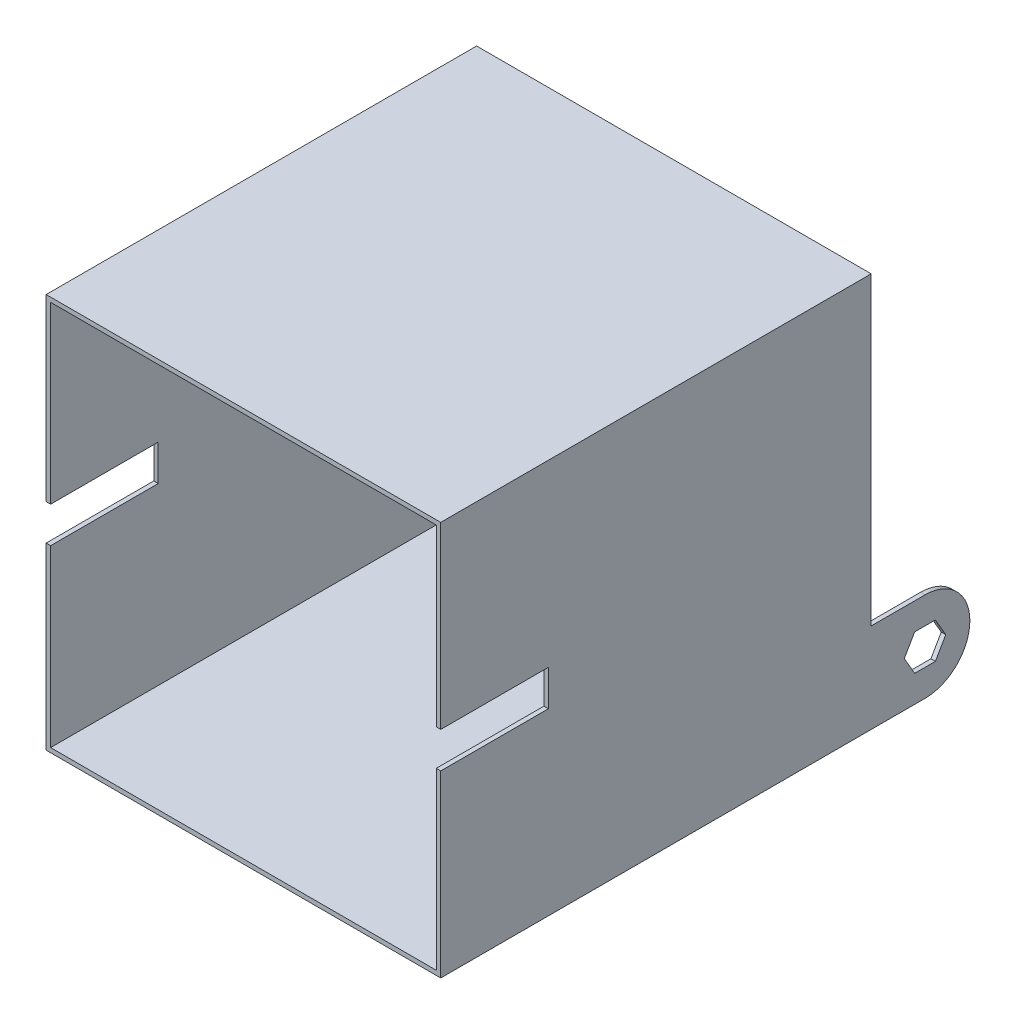
ISO-10303-21;
HEADER;
FILE_DESCRIPTION(('STEP AP214'),'2;1');
FILE_NAME('part.step','',(''),(''),'','','');
FILE_SCHEMA(('AUTOMOTIVE_DESIGN { 1 0 10303 214 1 1 1 1 }'));
ENDSEC;
DATA;
#1=APPLICATION_CONTEXT('core data for automotive mechanical design processes');
#2=APPLICATION_PROTOCOL_DEFINITION('international standard','automotive_design',2000,#1);
#3=PRODUCT_CONTEXT('',#1,'mechanical');
#4=PRODUCT('Part','Part','',(#3));
#5=PRODUCT_RELATED_PRODUCT_CATEGORY('part','',(#4));
#6=PRODUCT_DEFINITION_FORMATION('','',#4);
#7=PRODUCT_DEFINITION_CONTEXT('part definition',#1,'design');
#8=PRODUCT_DEFINITION('design','',#6,#7);
#9=PRODUCT_DEFINITION_SHAPE('','',#8);
#10=(LENGTH_UNIT() NAMED_UNIT(*) SI_UNIT(.MILLI.,.METRE.));
#11=(NAMED_UNIT(*) PLANE_ANGLE_UNIT() SI_UNIT($,.RADIAN.));
#12=(NAMED_UNIT(*) SI_UNIT($,.STERADIAN.) SOLID_ANGLE_UNIT());
#13=UNCERTAINTY_MEASURE_WITH_UNIT(LENGTH_MEASURE(1.E-05),#10,'distance_accuracy_value','');
#14=(GEOMETRIC_REPRESENTATION_CONTEXT(3) GLOBAL_UNCERTAINTY_ASSIGNED_CONTEXT((#13)) GLOBAL_UNIT_ASSIGNED_CONTEXT((#10,
#11,#12)) REPRESENTATION_CONTEXT('',''));
#15=CARTESIAN_POINT('',(0.,0.,0.));
#16=DIRECTION('',(0.,0.,1.));
#17=DIRECTION('',(1.,0.,0.));
#18=AXIS2_PLACEMENT_3D('',#15,#16,#17);
#19=CARTESIAN_POINT('',(0.,0.,0.));
#20=DIRECTION('',(0.,0.,-1.));
#21=DIRECTION('',(-1.,0.,0.));
#22=AXIS2_PLACEMENT_3D('',#19,#20,#21);
#23=PLANE('',#22);
#24=CARTESIAN_POINT('',(139.7,139.7,0.));
#25=DIRECTION('',(0.,0.,-1.));
#26=DIRECTION('',(-1.,0.,0.));
#27=AXIS2_PLACEMENT_3D('',#24,#25,#26);
#28=CIRCLE('',#27,12.7);
#29=CARTESIAN_POINT('',(127.,139.7,0.));
#30=VERTEX_POINT('',#29);
#31=EDGE_CURVE('E289',#30,#30,#28,.T.);
#32=ORIENTED_EDGE('',*,*,#31,.F.);
#33=EDGE_LOOP('',(#32));
#34=FACE_BOUND('',#33,.T.);
#35=DIRECTION('',(0.,1.,0.));
#36=VECTOR('',#35,1.);
#37=CARTESIAN_POINT('',(3.175,0.,0.));
#38=LINE('',#37,#36);
#39=CARTESIAN_POINT('',(3.175,0.,0.));
#40=VERTEX_POINT('',#39);
#41=CARTESIAN_POINT('',(3.175,63.5,0.));
#42=VERTEX_POINT('',#41);
#43=EDGE_CURVE('E266',#40,#42,#38,.T.);
#44=ORIENTED_EDGE('',*,*,#43,.T.);
#45=DIRECTION('',(-1.,0.,0.));
#46=VECTOR('',#45,1.);
#47=CARTESIAN_POINT('',(3.175,63.5,0.));
#48=LINE('',#47,#46);
#49=CARTESIAN_POINT('',(0.,63.5,0.));
#50=VERTEX_POINT('',#49);
#51=EDGE_CURVE('E277',#42,#50,#48,.T.);
#52=ORIENTED_EDGE('',*,*,#51,.T.);
#53=DIRECTION('',(0.,-1.,0.));
#54=VECTOR('',#53,1.);
#55=CARTESIAN_POINT('',(0.,0.,0.));
#56=LINE('',#55,#54);
#57=CARTESIAN_POINT('',(0.,279.4,0.));
#58=VERTEX_POINT('',#57);
#59=EDGE_CURVE('E418',#58,#50,#56,.T.);
#60=ORIENTED_EDGE('',*,*,#59,.F.);
#61=DIRECTION('',(-1.,0.,0.));
#62=VECTOR('',#61,1.);
#63=CARTESIAN_POINT('',(0.,279.4,0.));
#64=LINE('',#63,#62);
#65=CARTESIAN_POINT('',(279.4,279.4,0.));
#66=VERTEX_POINT('',#65);
#67=EDGE_CURVE('E425',#66,#58,#64,.T.);
#68=ORIENTED_EDGE('',*,*,#67,.F.);
#69=DIRECTION('',(0.,1.,0.));
#70=VECTOR('',#69,1.);
#71=CARTESIAN_POINT('',(279.4,0.,0.));
#72=LINE('',#71,#70);
#73=CARTESIAN_POINT('',(279.4,63.5,0.));
#74=VERTEX_POINT('',#73);
#75=EDGE_CURVE('E60',#74,#66,#72,.T.);
#76=ORIENTED_EDGE('',*,*,#75,.F.);
#77=DIRECTION('',(1.,0.,0.));
#78=VECTOR('',#77,1.);
#79=CARTESIAN_POINT('',(276.225,63.5,0.));
#80=LINE('',#79,#78);
#81=CARTESIAN_POINT('',(276.225,63.5,0.));
#82=VERTEX_POINT('',#81);
#83=EDGE_CURVE('E405',#82,#74,#80,.T.);
#84=ORIENTED_EDGE('',*,*,#83,.F.);
#85=DIRECTION('',(0.,1.,0.));
#86=VECTOR('',#85,1.);
#87=CARTESIAN_POINT('',(276.225,0.,0.));
#88=LINE('',#87,#86);
#89=CARTESIAN_POINT('',(276.225,0.,0.));
#90=VERTEX_POINT('',#89);
#91=EDGE_CURVE('E352',#90,#82,#88,.T.);
#92=ORIENTED_EDGE('',*,*,#91,.F.);
#93=DIRECTION('',(1.,0.,0.));
#94=VECTOR('',#93,1.);
#95=CARTESIAN_POINT('',(0.,0.,0.));
#96=LINE('',#95,#94);
#97=EDGE_CURVE('E52',#40,#90,#96,.T.);
#98=ORIENTED_EDGE('',*,*,#97,.F.);
#99=EDGE_LOOP('',(#44,#52,#60,#68,#76,#84,#92,#98));
#100=FACE_BOUND('',#99,.T.);
#101=ADVANCED_FACE('F35',(#34,#100),#23,.T.);
#102=CARTESIAN_POINT('',(0.,0.,304.8));
#103=DIRECTION('',(0.,0.,-1.));
#104=DIRECTION('',(-1.,0.,0.));
#105=AXIS2_PLACEMENT_3D('',#102,#103,#104);
#106=PLANE('',#105);
#107=DIRECTION('',(0.,-1.,0.));
#108=VECTOR('',#107,1.);
#109=CARTESIAN_POINT('',(0.,0.,304.8));
#110=LINE('',#109,#108);
#111=CARTESIAN_POINT('',(0.,279.4,304.8));
#112=VERTEX_POINT('',#111);
#113=CARTESIAN_POINT('',(0.,152.4,304.8));
#114=VERTEX_POINT('',#113);
#115=EDGE_CURVE('E532',#112,#114,#110,.T.);
#116=ORIENTED_EDGE('',*,*,#115,.T.);
#117=DIRECTION('',(-1.,0.,0.));
#118=VECTOR('',#117,1.);
#119=CARTESIAN_POINT('',(279.4,152.4,304.8));
#120=LINE('',#119,#118);
#121=CARTESIAN_POINT('',(3.17499999999998,152.4,304.8));
#122=VERTEX_POINT('',#121);
#123=EDGE_CURVE('E485',#122,#114,#120,.T.);
#124=ORIENTED_EDGE('',*,*,#123,.F.);
#125=DIRECTION('',(0.,-1.,0.));
#126=VECTOR('',#125,1.);
#127=CARTESIAN_POINT('',(3.175,0.,304.8));
#128=LINE('',#127,#126);
#129=CARTESIAN_POINT('',(3.175,276.225,304.8));
#130=VERTEX_POINT('',#129);
#131=EDGE_CURVE('E524',#130,#122,#128,.T.);
#132=ORIENTED_EDGE('',*,*,#131,.F.);
#133=DIRECTION('',(-1.,0.,0.));
#134=VECTOR('',#133,1.);
#135=CARTESIAN_POINT('',(0.,276.225,304.8));
#136=LINE('',#135,#134);
#137=CARTESIAN_POINT('',(276.225,276.225,304.8));
#138=VERTEX_POINT('',#137);
#139=EDGE_CURVE('E513',#138,#130,#136,.T.);
#140=ORIENTED_EDGE('',*,*,#139,.F.);
#141=DIRECTION('',(0.,1.,0.));
#142=VECTOR('',#141,1.);
#143=CARTESIAN_POINT('',(276.225,0.,304.8));
#144=LINE('',#143,#142);
#145=CARTESIAN_POINT('',(276.225,152.4,304.8));
#146=VERTEX_POINT('',#145);
#147=EDGE_CURVE('E529',#146,#138,#144,.T.);
#148=ORIENTED_EDGE('',*,*,#147,.F.);
#149=CARTESIAN_POINT('',(279.4,152.4,304.8));
#150=VERTEX_POINT('',#149);
#151=EDGE_CURVE('E488',#150,#146,#120,.T.);
#152=ORIENTED_EDGE('',*,*,#151,.F.);
#153=DIRECTION('',(0.,1.,0.));
#154=VECTOR('',#153,1.);
#155=CARTESIAN_POINT('',(279.4,0.,304.8));
#156=LINE('',#155,#154);
#157=CARTESIAN_POINT('',(279.4,279.4,304.8));
#158=VERTEX_POINT('',#157);
#159=EDGE_CURVE('E538',#150,#158,#156,.T.);
#160=ORIENTED_EDGE('',*,*,#159,.T.);
#161=DIRECTION('',(-1.,0.,0.));
#162=VECTOR('',#161,1.);
#163=CARTESIAN_POINT('',(0.,279.4,304.8));
#164=LINE('',#163,#162);
#165=EDGE_CURVE('E539',#158,#112,#164,.T.);
#166=ORIENTED_EDGE('',*,*,#165,.T.);
#167=EDGE_LOOP('',(#116,#124,#132,#140,#148,#152,#160,#166));
#168=FACE_BOUND('',#167,.T.);
#169=ADVANCED_FACE('F564',(#168),#106,.F.);
#170=CARTESIAN_POINT('',(279.4,0.,304.8));
#171=VERTEX_POINT('',#170);
#172=CARTESIAN_POINT('',(279.4,127.,304.8));
#173=VERTEX_POINT('',#172);
#174=EDGE_CURVE('E452',#171,#173,#156,.T.);
#175=ORIENTED_EDGE('',*,*,#174,.T.);
#176=DIRECTION('',(-1.,0.,0.));
#177=VECTOR('',#176,1.);
#178=CARTESIAN_POINT('',(279.4,127.,304.8));
#179=LINE('',#178,#177);
#180=CARTESIAN_POINT('',(276.225,127.,304.8));
#181=VERTEX_POINT('',#180);
#182=EDGE_CURVE('E481',#173,#181,#179,.T.);
#183=ORIENTED_EDGE('',*,*,#182,.T.);
#184=CARTESIAN_POINT('',(276.225,3.175,304.8));
#185=VERTEX_POINT('',#184);
#186=EDGE_CURVE('E477',#185,#181,#144,.T.);
#187=ORIENTED_EDGE('',*,*,#186,.F.);
#188=DIRECTION('',(1.,0.,0.));
#189=VECTOR('',#188,1.);
#190=CARTESIAN_POINT('',(0.,3.175,304.8));
#191=LINE('',#190,#189);
#192=CARTESIAN_POINT('',(3.175,3.175,304.8));
#193=VERTEX_POINT('',#192);
#194=EDGE_CURVE('E527',#193,#185,#191,.T.);
#195=ORIENTED_EDGE('',*,*,#194,.F.);
#196=CARTESIAN_POINT('',(3.175,127.,304.8));
#197=VERTEX_POINT('',#196);
#198=EDGE_CURVE('E523',#197,#193,#128,.T.);
#199=ORIENTED_EDGE('',*,*,#198,.F.);
#200=CARTESIAN_POINT('',(0.,127.,304.8));
#201=VERTEX_POINT('',#200);
#202=EDGE_CURVE('E486',#197,#201,#179,.T.);
#203=ORIENTED_EDGE('',*,*,#202,.T.);
#204=CARTESIAN_POINT('',(0.,0.,304.8));
#205=VERTEX_POINT('',#204);
#206=EDGE_CURVE('E536',#201,#205,#110,.T.);
#207=ORIENTED_EDGE('',*,*,#206,.T.);
#208=DIRECTION('',(1.,0.,0.));
#209=VECTOR('',#208,1.);
#210=CARTESIAN_POINT('',(0.,0.,304.8));
#211=LINE('',#210,#209);
#212=EDGE_CURVE('E535',#205,#171,#211,.T.);
#213=ORIENTED_EDGE('',*,*,#212,.T.);
#214=EDGE_LOOP('',(#175,#183,#187,#195,#199,#203,#207,#213));
#215=FACE_BOUND('',#214,.T.);
#216=ADVANCED_FACE('F483',(#215),#106,.F.);
#217=CARTESIAN_POINT('',(0.,0.,304.8));
#218=DIRECTION('',(1.,0.,0.));
#219=DIRECTION('',(0.,0.,-1.));
#220=AXIS2_PLACEMENT_3D('',#217,#218,#219);
#221=PLANE('',#220);
#222=DIRECTION('',(0.,-1.,0.));
#223=VECTOR('',#222,1.);
#224=CARTESIAN_POINT('',(0.,152.4,228.6));
#225=LINE('',#224,#223);
#226=CARTESIAN_POINT('',(0.,152.4,228.6));
#227=VERTEX_POINT('',#226);
#228=CARTESIAN_POINT('',(0.,127.,228.6));
#229=VERTEX_POINT('',#228);
#230=EDGE_CURVE('E386',#227,#229,#225,.T.);
#231=ORIENTED_EDGE('',*,*,#230,.F.);
#232=DIRECTION('',(0.,0.,-1.));
#233=VECTOR('',#232,1.);
#234=CARTESIAN_POINT('',(0.,152.4,228.6));
#235=LINE('',#234,#233);
#236=EDGE_CURVE('E574',#114,#227,#235,.T.);
#237=ORIENTED_EDGE('',*,*,#236,.F.);
#238=ORIENTED_EDGE('',*,*,#115,.F.);
#239=DIRECTION('',(0.,0.,-1.));
#240=VECTOR('',#239,1.);
#241=CARTESIAN_POINT('',(0.,279.4,304.8));
#242=LINE('',#241,#240);
#243=EDGE_CURVE('E458',#112,#58,#242,.T.);
#244=ORIENTED_EDGE('',*,*,#243,.T.);
#245=ORIENTED_EDGE('',*,*,#59,.T.);
#246=DIRECTION('',(0.,0.,1.));
#247=VECTOR('',#246,1.);
#248=CARTESIAN_POINT('',(0.,63.5,0.));
#249=LINE('',#248,#247);
#250=CARTESIAN_POINT('',(0.,63.5,-38.1));
#251=VERTEX_POINT('',#250);
#252=EDGE_CURVE('E313',#251,#50,#249,.T.);
#253=ORIENTED_EDGE('',*,*,#252,.F.);
#254=CARTESIAN_POINT('',(0.,31.75,-38.1));
#255=DIRECTION('',(1.,0.,0.));
#256=DIRECTION('',(0.,0.,-1.));
#257=AXIS2_PLACEMENT_3D('',#254,#255,#256);
#258=CIRCLE('',#257,31.75);
#259=CARTESIAN_POINT('',(0.,0.,-38.1));
#260=VERTEX_POINT('',#259);
#261=EDGE_CURVE('E311',#260,#251,#258,.T.);
#262=ORIENTED_EDGE('',*,*,#261,.F.);
#263=DIRECTION('',(0.,0.,-1.));
#264=VECTOR('',#263,1.);
#265=CARTESIAN_POINT('',(0.,0.,304.8));
#266=LINE('',#265,#264);
#267=EDGE_CURVE('E273',#205,#260,#266,.T.);
#268=ORIENTED_EDGE('',*,*,#267,.F.);
#269=ORIENTED_EDGE('',*,*,#206,.F.);
#270=DIRECTION('',(0.,0.,1.));
#271=VECTOR('',#270,1.);
#272=CARTESIAN_POINT('',(0.,127.,228.6));
#273=LINE('',#272,#271);
#274=EDGE_CURVE('E557',#229,#201,#273,.T.);
#275=ORIENTED_EDGE('',*,*,#274,.F.);
#276=EDGE_LOOP('',(#231,#237,#238,#244,#245,#253,#262,#268,#269,#275));
#277=FACE_BOUND('',#276,.T.);
#278=DIRECTION('',(0.,0.,1.));
#279=VECTOR('',#278,1.);
#280=CARTESIAN_POINT('',(0.,44.45,0.));
#281=LINE('',#280,#279);
#282=CARTESIAN_POINT('',(0.,44.45,-45.4323484187082));
#283=VERTEX_POINT('',#282);
#284=CARTESIAN_POINT('',(0.,44.45,-30.7676515812917));
#285=VERTEX_POINT('',#284);
#286=EDGE_CURVE('E315',#283,#285,#281,.T.);
#287=ORIENTED_EDGE('',*,*,#286,.T.);
#288=DIRECTION('',(0.,-0.866025403784439,0.5));
#289=VECTOR('',#288,1.);
#290=CARTESIAN_POINT('',(0.,-2.21028394209355,-3.82832408685966));
#291=LINE('',#290,#289);
#292=CARTESIAN_POINT('',(0.,31.75,-23.4353031625835));
#293=VERTEX_POINT('',#292);
#294=EDGE_CURVE('E318',#285,#293,#291,.T.);
#295=ORIENTED_EDGE('',*,*,#294,.T.);
#296=DIRECTION('',(0.,-0.866025403784439,-0.5));
#297=VECTOR('',#296,1.);
#298=CARTESIAN_POINT('',(0.,18.0852839420935,-31.3246306570156));
#299=LINE('',#298,#297);
#300=CARTESIAN_POINT('',(0.,19.05,-30.7676515812917));
#301=VERTEX_POINT('',#300);
#302=EDGE_CURVE('E321',#293,#301,#299,.T.);
#303=ORIENTED_EDGE('',*,*,#302,.T.);
#304=DIRECTION('',(0.,0.,-1.));
#305=VECTOR('',#304,1.);
#306=CARTESIAN_POINT('',(0.,19.05,0.));
#307=LINE('',#306,#305);
#308=CARTESIAN_POINT('',(0.,19.05,-45.4323484187083));
#309=VERTEX_POINT('',#308);
#310=EDGE_CURVE('E324',#301,#309,#307,.T.);
#311=ORIENTED_EDGE('',*,*,#310,.T.);
#312=DIRECTION('',(0.,0.866025403784439,-0.5));
#313=VECTOR('',#312,1.);
#314=CARTESIAN_POINT('',(0.,-14.9102839420936,-25.8253693429844));
#315=LINE('',#314,#313);
#316=CARTESIAN_POINT('',(0.,31.75,-52.7646968374165));
#317=VERTEX_POINT('',#316);
#318=EDGE_CURVE('E286',#309,#317,#315,.T.);
#319=ORIENTED_EDGE('',*,*,#318,.T.);
#320=DIRECTION('',(0.,0.866025403784439,0.5));
#321=VECTOR('',#320,1.);
#322=CARTESIAN_POINT('',(0.,30.7852839420936,-53.3216759131403));
#323=LINE('',#322,#321);
#324=EDGE_CURVE('E283',#317,#283,#323,.T.);
#325=ORIENTED_EDGE('',*,*,#324,.T.);
#326=EDGE_LOOP('',(#287,#295,#303,#311,#319,#325));
#327=FACE_BOUND('',#326,.T.);
#328=ADVANCED_FACE('F37',(#277,#327),#221,.F.);
#329=CARTESIAN_POINT('',(0.,0.,304.8));
#330=DIRECTION('',(0.,1.,0.));
#331=DIRECTION('',(0.,0.,1.));
#332=AXIS2_PLACEMENT_3D('',#329,#330,#331);
#333=PLANE('',#332);
#334=ORIENTED_EDGE('',*,*,#267,.T.);
#335=DIRECTION('',(-1.,0.,0.));
#336=VECTOR('',#335,1.);
#337=CARTESIAN_POINT('',(3.175,0.,-38.1));
#338=LINE('',#337,#336);
#339=CARTESIAN_POINT('',(3.175,0.,-38.1));
#340=VERTEX_POINT('',#339);
#341=EDGE_CURVE('E269',#340,#260,#338,.T.);
#342=ORIENTED_EDGE('',*,*,#341,.F.);
#343=DIRECTION('',(0.,0.,-1.));
#344=VECTOR('',#343,1.);
#345=CARTESIAN_POINT('',(3.175,0.,0.));
#346=LINE('',#345,#344);
#347=EDGE_CURVE('E258',#40,#340,#346,.T.);
#348=ORIENTED_EDGE('',*,*,#347,.F.);
#349=ORIENTED_EDGE('',*,*,#97,.T.);
#350=DIRECTION('',(0.,0.,-1.));
#351=VECTOR('',#350,1.);
#352=CARTESIAN_POINT('',(276.225,0.,0.));
#353=LINE('',#352,#351);
#354=CARTESIAN_POINT('',(276.225,0.,-38.1));
#355=VERTEX_POINT('',#354);
#356=EDGE_CURVE('E357',#90,#355,#353,.T.);
#357=ORIENTED_EDGE('',*,*,#356,.T.);
#358=DIRECTION('',(1.,0.,0.));
#359=VECTOR('',#358,1.);
#360=CARTESIAN_POINT('',(276.225,0.,-38.1));
#361=LINE('',#360,#359);
#362=CARTESIAN_POINT('',(279.4,0.,-38.1));
#363=VERTEX_POINT('',#362);
#364=EDGE_CURVE('E402',#355,#363,#361,.T.);
#365=ORIENTED_EDGE('',*,*,#364,.T.);
#366=DIRECTION('',(0.,0.,-1.));
#367=VECTOR('',#366,1.);
#368=CARTESIAN_POINT('',(279.4,0.,304.8));
#369=LINE('',#368,#367);
#370=EDGE_CURVE('E449',#171,#363,#369,.T.);
#371=ORIENTED_EDGE('',*,*,#370,.F.);
#372=ORIENTED_EDGE('',*,*,#212,.F.);
#373=EDGE_LOOP('',(#334,#342,#348,#349,#357,#365,#371,#372));
#374=FACE_BOUND('',#373,.T.);
#375=ADVANCED_FACE('F270',(#374),#333,.F.);
#376=CARTESIAN_POINT('',(279.4,0.,304.8));
#377=DIRECTION('',(-1.,0.,0.));
#378=DIRECTION('',(0.,0.,1.));
#379=AXIS2_PLACEMENT_3D('',#376,#377,#378);
#380=PLANE('',#379);
#381=ORIENTED_EDGE('',*,*,#159,.F.);
#382=DIRECTION('',(0.,0.,-1.));
#383=VECTOR('',#382,1.);
#384=CARTESIAN_POINT('',(279.4,152.4,228.6));
#385=LINE('',#384,#383);
#386=CARTESIAN_POINT('',(279.4,152.4,228.6));
#387=VERTEX_POINT('',#386);
#388=EDGE_CURVE('E562',#150,#387,#385,.T.);
#389=ORIENTED_EDGE('',*,*,#388,.T.);
#390=DIRECTION('',(0.,-1.,0.));
#391=VECTOR('',#390,1.);
#392=CARTESIAN_POINT('',(279.4,152.4,228.6));
#393=LINE('',#392,#391);
#394=CARTESIAN_POINT('',(279.4,127.,228.6));
#395=VERTEX_POINT('',#394);
#396=EDGE_CURVE('E576',#387,#395,#393,.T.);
#397=ORIENTED_EDGE('',*,*,#396,.T.);
#398=DIRECTION('',(0.,0.,1.));
#399=VECTOR('',#398,1.);
#400=CARTESIAN_POINT('',(279.4,127.,228.6));
#401=LINE('',#400,#399);
#402=EDGE_CURVE('E580',#395,#173,#401,.T.);
#403=ORIENTED_EDGE('',*,*,#402,.T.);
#404=ORIENTED_EDGE('',*,*,#174,.F.);
#405=ORIENTED_EDGE('',*,*,#370,.T.);
#406=CARTESIAN_POINT('',(279.4,31.75,-38.1));
#407=DIRECTION('',(1.,0.,0.));
#408=DIRECTION('',(0.,0.,-1.));
#409=AXIS2_PLACEMENT_3D('',#406,#407,#408);
#410=CIRCLE('',#409,31.75);
#411=CARTESIAN_POINT('',(279.4,63.5,-38.1));
#412=VERTEX_POINT('',#411);
#413=EDGE_CURVE('E331',#363,#412,#410,.T.);
#414=ORIENTED_EDGE('',*,*,#413,.T.);
#415=DIRECTION('',(0.,0.,1.));
#416=VECTOR('',#415,1.);
#417=CARTESIAN_POINT('',(279.4,63.5,0.));
#418=LINE('',#417,#416);
#419=EDGE_CURVE('E370',#412,#74,#418,.T.);
#420=ORIENTED_EDGE('',*,*,#419,.T.);
#421=ORIENTED_EDGE('',*,*,#75,.T.);
#422=DIRECTION('',(0.,0.,-1.));
#423=VECTOR('',#422,1.);
#424=CARTESIAN_POINT('',(279.4,279.4,304.8));
#425=LINE('',#424,#423);
#426=EDGE_CURVE('E453',#158,#66,#425,.T.);
#427=ORIENTED_EDGE('',*,*,#426,.F.);
#428=EDGE_LOOP('',(#381,#389,#397,#403,#404,#405,#414,#420,#421,#427));
#429=FACE_BOUND('',#428,.T.);
#430=DIRECTION('',(0.,0.,1.));
#431=VECTOR('',#430,1.);
#432=CARTESIAN_POINT('',(279.4,44.45,0.));
#433=LINE('',#432,#431);
#434=CARTESIAN_POINT('',(279.4,44.45,-45.4323484187082));
#435=VERTEX_POINT('',#434);
#436=CARTESIAN_POINT('',(279.4,44.45,-30.7676515812917));
#437=VERTEX_POINT('',#436);
#438=EDGE_CURVE('E371',#435,#437,#433,.T.);
#439=ORIENTED_EDGE('',*,*,#438,.F.);
#440=DIRECTION('',(0.,0.866025403784439,0.5));
#441=VECTOR('',#440,1.);
#442=CARTESIAN_POINT('',(279.4,30.7852839420936,-53.3216759131403));
#443=LINE('',#442,#441);
#444=CARTESIAN_POINT('',(279.4,31.75,-52.7646968374165));
#445=VERTEX_POINT('',#444);
#446=EDGE_CURVE('E374',#445,#435,#443,.T.);
#447=ORIENTED_EDGE('',*,*,#446,.F.);
#448=DIRECTION('',(0.,0.866025403784439,-0.5));
#449=VECTOR('',#448,1.);
#450=CARTESIAN_POINT('',(279.4,-14.9102839420936,-25.8253693429844));
#451=LINE('',#450,#449);
#452=CARTESIAN_POINT('',(279.4,19.05,-45.4323484187083));
#453=VERTEX_POINT('',#452);
#454=EDGE_CURVE('E376',#453,#445,#451,.T.);
#455=ORIENTED_EDGE('',*,*,#454,.F.);
#456=DIRECTION('',(0.,0.,-1.));
#457=VECTOR('',#456,1.);
#458=CARTESIAN_POINT('',(279.4,19.05,0.));
#459=LINE('',#458,#457);
#460=CARTESIAN_POINT('',(279.4,19.05,-30.7676515812917));
#461=VERTEX_POINT('',#460);
#462=EDGE_CURVE('E378',#461,#453,#459,.T.);
#463=ORIENTED_EDGE('',*,*,#462,.F.);
#464=DIRECTION('',(0.,-0.866025403784439,-0.5));
#465=VECTOR('',#464,1.);
#466=CARTESIAN_POINT('',(279.4,18.0852839420935,-31.3246306570156));
#467=LINE('',#466,#465);
#468=CARTESIAN_POINT('',(279.4,31.75,-23.4353031625835));
#469=VERTEX_POINT('',#468);
#470=EDGE_CURVE('E380',#469,#461,#467,.T.);
#471=ORIENTED_EDGE('',*,*,#470,.F.);
#472=DIRECTION('',(0.,-0.866025403784439,0.5));
#473=VECTOR('',#472,1.);
#474=CARTESIAN_POINT('',(279.4,-2.21028394209355,-3.82832408685966));
#475=LINE('',#474,#473);
#476=EDGE_CURVE('E349',#437,#469,#475,.T.);
#477=ORIENTED_EDGE('',*,*,#476,.F.);
#478=EDGE_LOOP('',(#439,#447,#455,#463,#471,#477));
#479=FACE_BOUND('',#478,.T.);
#480=ADVANCED_FACE('F446',(#429,#479),#380,.F.);
#481=CARTESIAN_POINT('',(0.,279.4,304.8));
#482=DIRECTION('',(0.,-1.,0.));
#483=DIRECTION('',(0.,0.,-1.));
#484=AXIS2_PLACEMENT_3D('',#481,#482,#483);
#485=PLANE('',#484);
#486=ORIENTED_EDGE('',*,*,#67,.T.);
#487=ORIENTED_EDGE('',*,*,#243,.F.);
#488=ORIENTED_EDGE('',*,*,#165,.F.);
#489=ORIENTED_EDGE('',*,*,#426,.T.);
#490=EDGE_LOOP('',(#486,#487,#488,#489));
#491=FACE_BOUND('',#490,.T.);
#492=ADVANCED_FACE('F558',(#491),#485,.F.);
#493=CARTESIAN_POINT('',(3.175,0.,304.8));
#494=DIRECTION('',(1.,0.,0.));
#495=DIRECTION('',(0.,0.,-1.));
#496=AXIS2_PLACEMENT_3D('',#493,#494,#495);
#497=PLANE('',#496);
#498=DIRECTION('',(0.,0.,1.));
#499=VECTOR('',#498,1.);
#500=CARTESIAN_POINT('',(3.175,152.4,304.8));
#501=LINE('',#500,#499);
#502=CARTESIAN_POINT('',(3.17499999999998,152.4,228.6));
#503=VERTEX_POINT('',#502);
#504=EDGE_CURVE('E497',#503,#122,#501,.T.);
#505=ORIENTED_EDGE('',*,*,#504,.F.);
#506=DIRECTION('',(0.,1.,0.));
#507=VECTOR('',#506,1.);
#508=CARTESIAN_POINT('',(3.175,0.,228.6));
#509=LINE('',#508,#507);
#510=CARTESIAN_POINT('',(3.17499999999998,127.,228.6));
#511=VERTEX_POINT('',#510);
#512=EDGE_CURVE('E499',#511,#503,#509,.T.);
#513=ORIENTED_EDGE('',*,*,#512,.F.);
#514=DIRECTION('',(0.,0.,-1.));
#515=VECTOR('',#514,1.);
#516=CARTESIAN_POINT('',(3.175,127.,304.8));
#517=LINE('',#516,#515);
#518=EDGE_CURVE('E495',#197,#511,#517,.T.);
#519=ORIENTED_EDGE('',*,*,#518,.F.);
#520=ORIENTED_EDGE('',*,*,#198,.T.);
#521=DIRECTION('',(0.,0.,-1.));
#522=VECTOR('',#521,1.);
#523=CARTESIAN_POINT('',(3.175,3.175,304.8));
#524=LINE('',#523,#522);
#525=CARTESIAN_POINT('',(3.175,3.175,3.175));
#526=VERTEX_POINT('',#525);
#527=EDGE_CURVE('E505',#193,#526,#524,.T.);
#528=ORIENTED_EDGE('',*,*,#527,.T.);
#529=DIRECTION('',(0.,-1.,0.));
#530=VECTOR('',#529,1.);
#531=CARTESIAN_POINT('',(3.175,0.,3.175));
#532=LINE('',#531,#530);
#533=CARTESIAN_POINT('',(3.175,276.225,3.175));
#534=VERTEX_POINT('',#533);
#535=EDGE_CURVE('E501',#534,#526,#532,.T.);
#536=ORIENTED_EDGE('',*,*,#535,.F.);
#537=DIRECTION('',(0.,0.,-1.));
#538=VECTOR('',#537,1.);
#539=CARTESIAN_POINT('',(3.175,276.225,304.8));
#540=LINE('',#539,#538);
#541=EDGE_CURVE('E509',#130,#534,#540,.T.);
#542=ORIENTED_EDGE('',*,*,#541,.F.);
#543=ORIENTED_EDGE('',*,*,#131,.T.);
#544=EDGE_LOOP('',(#505,#513,#519,#520,#528,#536,#542,#543));
#545=FACE_BOUND('',#544,.T.);
#546=ADVANCED_FACE('F593',(#545),#497,.T.);
#547=CARTESIAN_POINT('',(0.,3.175,304.8));
#548=DIRECTION('',(0.,1.,0.));
#549=DIRECTION('',(0.,0.,1.));
#550=AXIS2_PLACEMENT_3D('',#547,#548,#549);
#551=PLANE('',#550);
#552=DIRECTION('',(1.,0.,0.));
#553=VECTOR('',#552,1.);
#554=CARTESIAN_POINT('',(0.,3.175,3.175));
#555=LINE('',#554,#553);
#556=CARTESIAN_POINT('',(276.225,3.175,3.175));
#557=VERTEX_POINT('',#556);
#558=EDGE_CURVE('E504',#526,#557,#555,.T.);
#559=ORIENTED_EDGE('',*,*,#558,.F.);
#560=ORIENTED_EDGE('',*,*,#527,.F.);
#561=ORIENTED_EDGE('',*,*,#194,.T.);
#562=DIRECTION('',(0.,0.,-1.));
#563=VECTOR('',#562,1.);
#564=CARTESIAN_POINT('',(276.225,3.175,304.8));
#565=LINE('',#564,#563);
#566=EDGE_CURVE('E508',#185,#557,#565,.T.);
#567=ORIENTED_EDGE('',*,*,#566,.T.);
#568=EDGE_LOOP('',(#559,#560,#561,#567));
#569=FACE_BOUND('',#568,.T.);
#570=ADVANCED_FACE('F658',(#569),#551,.T.);
#571=CARTESIAN_POINT('',(276.225,0.,304.8));
#572=DIRECTION('',(-1.,0.,0.));
#573=DIRECTION('',(0.,0.,1.));
#574=AXIS2_PLACEMENT_3D('',#571,#572,#573);
#575=PLANE('',#574);
#576=DIRECTION('',(0.,0.,-1.));
#577=VECTOR('',#576,1.);
#578=CARTESIAN_POINT('',(276.225,152.4,304.8));
#579=LINE('',#578,#577);
#580=CARTESIAN_POINT('',(276.225,152.4,228.6));
#581=VERTEX_POINT('',#580);
#582=EDGE_CURVE('E11',#146,#581,#579,.T.);
#583=ORIENTED_EDGE('',*,*,#582,.F.);
#584=ORIENTED_EDGE('',*,*,#147,.T.);
#585=DIRECTION('',(0.,0.,-1.));
#586=VECTOR('',#585,1.);
#587=CARTESIAN_POINT('',(276.225,276.225,304.8));
#588=LINE('',#587,#586);
#589=CARTESIAN_POINT('',(276.225,276.225,3.175));
#590=VERTEX_POINT('',#589);
#591=EDGE_CURVE('E512',#138,#590,#588,.T.);
#592=ORIENTED_EDGE('',*,*,#591,.T.);
#593=DIRECTION('',(0.,1.,0.));
#594=VECTOR('',#593,1.);
#595=CARTESIAN_POINT('',(276.225,0.,3.175));
#596=LINE('',#595,#594);
#597=EDGE_CURVE('E515',#557,#590,#596,.T.);
#598=ORIENTED_EDGE('',*,*,#597,.F.);
#599=ORIENTED_EDGE('',*,*,#566,.F.);
#600=ORIENTED_EDGE('',*,*,#186,.T.);
#601=DIRECTION('',(0.,0.,1.));
#602=VECTOR('',#601,1.);
#603=CARTESIAN_POINT('',(276.225,127.,304.8));
#604=LINE('',#603,#602);
#605=CARTESIAN_POINT('',(276.225,127.,228.6));
#606=VERTEX_POINT('',#605);
#607=EDGE_CURVE('E455',#606,#181,#604,.T.);
#608=ORIENTED_EDGE('',*,*,#607,.F.);
#609=DIRECTION('',(0.,-1.,0.));
#610=VECTOR('',#609,1.);
#611=CARTESIAN_POINT('',(276.225,0.,228.6));
#612=LINE('',#611,#610);
#613=EDGE_CURVE('E44',#581,#606,#612,.T.);
#614=ORIENTED_EDGE('',*,*,#613,.F.);
#615=EDGE_LOOP('',(#583,#584,#592,#598,#599,#600,#608,#614));
#616=FACE_BOUND('',#615,.T.);
#617=ADVANCED_FACE('F474',(#616),#575,.T.);
#618=CARTESIAN_POINT('',(0.,276.225,304.8));
#619=DIRECTION('',(0.,-1.,0.));
#620=DIRECTION('',(0.,0.,-1.));
#621=AXIS2_PLACEMENT_3D('',#618,#619,#620);
#622=PLANE('',#621);
#623=DIRECTION('',(-1.,0.,0.));
#624=VECTOR('',#623,1.);
#625=CARTESIAN_POINT('',(0.,276.225,3.175));
#626=LINE('',#625,#624);
#627=EDGE_CURVE('E519',#590,#534,#626,.T.);
#628=ORIENTED_EDGE('',*,*,#627,.F.);
#629=ORIENTED_EDGE('',*,*,#591,.F.);
#630=ORIENTED_EDGE('',*,*,#139,.T.);
#631=ORIENTED_EDGE('',*,*,#541,.T.);
#632=EDGE_LOOP('',(#628,#629,#630,#631));
#633=FACE_BOUND('',#632,.T.);
#634=ADVANCED_FACE('F597',(#633),#622,.T.);
#635=CARTESIAN_POINT('',(0.,0.,3.175));
#636=DIRECTION('',(0.,0.,-1.));
#637=DIRECTION('',(-1.,0.,0.));
#638=AXIS2_PLACEMENT_3D('',#635,#636,#637);
#639=PLANE('',#638);
#640=CARTESIAN_POINT('',(139.7,139.7,3.17499999999998));
#641=DIRECTION('',(0.,0.,-1.));
#642=DIRECTION('',(-1.,0.,0.));
#643=AXIS2_PLACEMENT_3D('',#640,#641,#642);
#644=CIRCLE('',#643,12.7);
#645=CARTESIAN_POINT('',(127.,139.7,3.17499999999998));
#646=VERTEX_POINT('',#645);
#647=EDGE_CURVE('E39',#646,#646,#644,.T.);
#648=ORIENTED_EDGE('',*,*,#647,.T.);
#649=EDGE_LOOP('',(#648));
#650=FACE_BOUND('',#649,.T.);
#651=ORIENTED_EDGE('',*,*,#535,.T.);
#652=ORIENTED_EDGE('',*,*,#558,.T.);
#653=ORIENTED_EDGE('',*,*,#597,.T.);
#654=ORIENTED_EDGE('',*,*,#627,.T.);
#655=EDGE_LOOP('',(#651,#652,#653,#654));
#656=FACE_BOUND('',#655,.T.);
#657=ADVANCED_FACE('F609',(#650,#656),#639,.F.);
#658=CARTESIAN_POINT('',(279.4,127.,228.6));
#659=DIRECTION('',(0.,-1.,0.));
#660=DIRECTION('',(0.,0.,-1.));
#661=AXIS2_PLACEMENT_3D('',#658,#659,#660);
#662=PLANE('',#661);
#663=ORIENTED_EDGE('',*,*,#607,.T.);
#664=ORIENTED_EDGE('',*,*,#182,.F.);
#665=ORIENTED_EDGE('',*,*,#402,.F.);
#666=DIRECTION('',(-1.,0.,0.));
#667=VECTOR('',#666,1.);
#668=CARTESIAN_POINT('',(279.4,127.,228.6));
#669=LINE('',#668,#667);
#670=EDGE_CURVE('E468',#395,#606,#669,.T.);
#671=ORIENTED_EDGE('',*,*,#670,.T.);
#672=EDGE_LOOP('',(#663,#664,#665,#671));
#673=FACE_BOUND('',#672,.T.);
#674=ADVANCED_FACE('F480',(#673),#662,.F.);
#675=CARTESIAN_POINT('',(279.4,152.4,228.6));
#676=DIRECTION('',(0.,1.,0.));
#677=DIRECTION('',(0.,0.,1.));
#678=AXIS2_PLACEMENT_3D('',#675,#676,#677);
#679=PLANE('',#678);
#680=ORIENTED_EDGE('',*,*,#582,.T.);
#681=DIRECTION('',(-1.,0.,0.));
#682=VECTOR('',#681,1.);
#683=CARTESIAN_POINT('',(279.4,152.4,228.6));
#684=LINE('',#683,#682);
#685=EDGE_CURVE('E470',#387,#581,#684,.T.);
#686=ORIENTED_EDGE('',*,*,#685,.F.);
#687=ORIENTED_EDGE('',*,*,#388,.F.);
#688=ORIENTED_EDGE('',*,*,#151,.T.);
#689=EDGE_LOOP('',(#680,#686,#687,#688));
#690=FACE_BOUND('',#689,.T.);
#691=ADVANCED_FACE('F600',(#690),#679,.F.);
#692=CARTESIAN_POINT('',(279.4,152.4,228.6));
#693=DIRECTION('',(0.,0.,-1.));
#694=DIRECTION('',(-1.,0.,0.));
#695=AXIS2_PLACEMENT_3D('',#692,#693,#694);
#696=PLANE('',#695);
#697=ORIENTED_EDGE('',*,*,#613,.T.);
#698=ORIENTED_EDGE('',*,*,#670,.F.);
#699=ORIENTED_EDGE('',*,*,#396,.F.);
#700=ORIENTED_EDGE('',*,*,#685,.T.);
#701=EDGE_LOOP('',(#697,#698,#699,#700));
#702=FACE_BOUND('',#701,.T.);
#703=ADVANCED_FACE('F466',(#702),#696,.F.);
#704=ORIENTED_EDGE('',*,*,#512,.T.);
#705=EDGE_CURVE('E568',#503,#227,#684,.T.);
#706=ORIENTED_EDGE('',*,*,#705,.T.);
#707=ORIENTED_EDGE('',*,*,#230,.T.);
#708=EDGE_CURVE('E494',#511,#229,#669,.T.);
#709=ORIENTED_EDGE('',*,*,#708,.F.);
#710=EDGE_LOOP('',(#704,#706,#707,#709));
#711=FACE_BOUND('',#710,.T.);
#712=ADVANCED_FACE('F586',(#711),#696,.F.);
#713=ORIENTED_EDGE('',*,*,#504,.T.);
#714=ORIENTED_EDGE('',*,*,#123,.T.);
#715=ORIENTED_EDGE('',*,*,#236,.T.);
#716=ORIENTED_EDGE('',*,*,#705,.F.);
#717=EDGE_LOOP('',(#713,#714,#715,#716));
#718=FACE_BOUND('',#717,.T.);
#719=ADVANCED_FACE('F603',(#718),#679,.F.);
#720=ORIENTED_EDGE('',*,*,#518,.T.);
#721=ORIENTED_EDGE('',*,*,#708,.T.);
#722=ORIENTED_EDGE('',*,*,#274,.T.);
#723=ORIENTED_EDGE('',*,*,#202,.F.);
#724=EDGE_LOOP('',(#720,#721,#722,#723));
#725=FACE_BOUND('',#724,.T.);
#726=ADVANCED_FACE('F583',(#725),#662,.F.);
#727=CARTESIAN_POINT('',(276.225,44.45,0.));
#728=DIRECTION('',(0.,1.,0.));
#729=DIRECTION('',(0.,0.,1.));
#730=AXIS2_PLACEMENT_3D('',#727,#728,#729);
#731=PLANE('',#730);
#732=ORIENTED_EDGE('',*,*,#438,.T.);
#733=DIRECTION('',(1.,0.,0.));
#734=VECTOR('',#733,1.);
#735=CARTESIAN_POINT('',(276.225,44.45,-30.7676515812917));
#736=LINE('',#735,#734);
#737=CARTESIAN_POINT('',(276.225,44.45,-30.7676515812917));
#738=VERTEX_POINT('',#737);
#739=EDGE_CURVE('E383',#738,#437,#736,.T.);
#740=ORIENTED_EDGE('',*,*,#739,.F.);
#741=DIRECTION('',(0.,0.,1.));
#742=VECTOR('',#741,1.);
#743=CARTESIAN_POINT('',(276.225,44.45,0.));
#744=LINE('',#743,#742);
#745=CARTESIAN_POINT('',(276.225,44.45,-45.4323484187082));
#746=VERTEX_POINT('',#745);
#747=EDGE_CURVE('E353',#746,#738,#744,.T.);
#748=ORIENTED_EDGE('',*,*,#747,.F.);
#749=DIRECTION('',(1.,0.,0.));
#750=VECTOR('',#749,1.);
#751=CARTESIAN_POINT('',(276.225,44.45,-45.4323484187082));
#752=LINE('',#751,#750);
#753=EDGE_CURVE('E399',#746,#435,#752,.T.);
#754=ORIENTED_EDGE('',*,*,#753,.T.);
#755=EDGE_LOOP('',(#732,#740,#748,#754));
#756=FACE_BOUND('',#755,.T.);
#757=ADVANCED_FACE('F721',(#756),#731,.F.);
#758=CARTESIAN_POINT('',(276.225,-2.21028394209355,-3.82832408685966));
#759=DIRECTION('',(0.,0.5,0.866025403784438));
#760=DIRECTION('',(0.,-0.866025403784439,0.5));
#761=AXIS2_PLACEMENT_3D('',#758,#759,#760);
#762=PLANE('',#761);
#763=ORIENTED_EDGE('',*,*,#476,.T.);
#764=DIRECTION('',(1.,0.,0.));
#765=VECTOR('',#764,1.);
#766=CARTESIAN_POINT('',(276.225,31.75,-23.4353031625835));
#767=LINE('',#766,#765);
#768=CARTESIAN_POINT('',(276.225,31.75,-23.4353031625835));
#769=VERTEX_POINT('',#768);
#770=EDGE_CURVE('E387',#769,#469,#767,.T.);
#771=ORIENTED_EDGE('',*,*,#770,.F.);
#772=DIRECTION('',(0.,-0.866025403784439,0.5));
#773=VECTOR('',#772,1.);
#774=CARTESIAN_POINT('',(276.225,-2.21028394209355,-3.82832408685966));
#775=LINE('',#774,#773);
#776=EDGE_CURVE('E365',#738,#769,#775,.T.);
#777=ORIENTED_EDGE('',*,*,#776,.F.);
#778=ORIENTED_EDGE('',*,*,#739,.T.);
#779=EDGE_LOOP('',(#763,#771,#777,#778));
#780=FACE_BOUND('',#779,.T.);
#781=ADVANCED_FACE('F736',(#780),#762,.F.);
#782=CARTESIAN_POINT('',(276.225,18.0852839420935,-31.3246306570156));
#783=DIRECTION('',(0.,-0.5,0.866025403784439));
#784=DIRECTION('',(0.,-0.866025403784439,-0.5));
#785=AXIS2_PLACEMENT_3D('',#782,#783,#784);
#786=PLANE('',#785);
#787=ORIENTED_EDGE('',*,*,#470,.T.);
#788=DIRECTION('',(1.,0.,0.));
#789=VECTOR('',#788,1.);
#790=CARTESIAN_POINT('',(276.225,19.05,-30.7676515812917));
#791=LINE('',#790,#789);
#792=CARTESIAN_POINT('',(276.225,19.05,-30.7676515812917));
#793=VERTEX_POINT('',#792);
#794=EDGE_CURVE('E390',#793,#461,#791,.T.);
#795=ORIENTED_EDGE('',*,*,#794,.F.);
#796=DIRECTION('',(0.,-0.866025403784439,-0.5));
#797=VECTOR('',#796,1.);
#798=CARTESIAN_POINT('',(276.225,18.0852839420935,-31.3246306570156));
#799=LINE('',#798,#797);
#800=EDGE_CURVE('E363',#769,#793,#799,.T.);
#801=ORIENTED_EDGE('',*,*,#800,.F.);
#802=ORIENTED_EDGE('',*,*,#770,.T.);
#803=EDGE_LOOP('',(#787,#795,#801,#802));
#804=FACE_BOUND('',#803,.T.);
#805=ADVANCED_FACE('F746',(#804),#786,.F.);
#806=CARTESIAN_POINT('',(276.225,19.05,0.));
#807=DIRECTION('',(0.,-1.,0.));
#808=DIRECTION('',(0.,0.,-1.));
#809=AXIS2_PLACEMENT_3D('',#806,#807,#808);
#810=PLANE('',#809);
#811=ORIENTED_EDGE('',*,*,#462,.T.);
#812=DIRECTION('',(1.,0.,0.));
#813=VECTOR('',#812,1.);
#814=CARTESIAN_POINT('',(276.225,19.05,-45.4323484187083));
#815=LINE('',#814,#813);
#816=CARTESIAN_POINT('',(276.225,19.05,-45.4323484187083));
#817=VERTEX_POINT('',#816);
#818=EDGE_CURVE('E393',#817,#453,#815,.T.);
#819=ORIENTED_EDGE('',*,*,#818,.F.);
#820=DIRECTION('',(0.,0.,-1.));
#821=VECTOR('',#820,1.);
#822=CARTESIAN_POINT('',(276.225,19.05,0.));
#823=LINE('',#822,#821);
#824=EDGE_CURVE('E361',#793,#817,#823,.T.);
#825=ORIENTED_EDGE('',*,*,#824,.F.);
#826=ORIENTED_EDGE('',*,*,#794,.T.);
#827=EDGE_LOOP('',(#811,#819,#825,#826));
#828=FACE_BOUND('',#827,.T.);
#829=ADVANCED_FACE('F756',(#828),#810,.F.);
#830=CARTESIAN_POINT('',(276.225,-14.9102839420936,-25.8253693429844));
#831=DIRECTION('',(0.,-0.5,-0.866025403784439));
#832=DIRECTION('',(0.,0.866025403784439,-0.5));
#833=AXIS2_PLACEMENT_3D('',#830,#831,#832);
#834=PLANE('',#833);
#835=ORIENTED_EDGE('',*,*,#454,.T.);
#836=DIRECTION('',(1.,0.,0.));
#837=VECTOR('',#836,1.);
#838=CARTESIAN_POINT('',(276.225,31.75,-52.7646968374165));
#839=LINE('',#838,#837);
#840=CARTESIAN_POINT('',(276.225,31.75,-52.7646968374165));
#841=VERTEX_POINT('',#840);
#842=EDGE_CURVE('E396',#841,#445,#839,.T.);
#843=ORIENTED_EDGE('',*,*,#842,.F.);
#844=DIRECTION('',(0.,0.866025403784439,-0.5));
#845=VECTOR('',#844,1.);
#846=CARTESIAN_POINT('',(276.225,-14.9102839420936,-25.8253693429844));
#847=LINE('',#846,#845);
#848=EDGE_CURVE('E359',#817,#841,#847,.T.);
#849=ORIENTED_EDGE('',*,*,#848,.F.);
#850=ORIENTED_EDGE('',*,*,#818,.T.);
#851=EDGE_LOOP('',(#835,#843,#849,#850));
#852=FACE_BOUND('',#851,.T.);
#853=ADVANCED_FACE('F766',(#852),#834,.F.);
#854=CARTESIAN_POINT('',(276.225,31.75,-38.1));
#855=DIRECTION('',(1.,0.,0.));
#856=DIRECTION('',(0.,0.,-1.));
#857=AXIS2_PLACEMENT_3D('',#854,#855,#856);
#858=CYLINDRICAL_SURFACE('',#857,31.75);
#859=ORIENTED_EDGE('',*,*,#413,.F.);
#860=ORIENTED_EDGE('',*,*,#364,.F.);
#861=CARTESIAN_POINT('',(276.225,31.75,-38.1));
#862=DIRECTION('',(1.,0.,0.));
#863=DIRECTION('',(0.,0.,-1.));
#864=AXIS2_PLACEMENT_3D('',#861,#862,#863);
#865=CIRCLE('',#864,31.75);
#866=CARTESIAN_POINT('',(276.225,63.5,-38.1));
#867=VERTEX_POINT('',#866);
#868=EDGE_CURVE('E345',#355,#867,#865,.T.);
#869=ORIENTED_EDGE('',*,*,#868,.T.);
#870=DIRECTION('',(1.,0.,0.));
#871=VECTOR('',#870,1.);
#872=CARTESIAN_POINT('',(276.225,63.5,-38.1));
#873=LINE('',#872,#871);
#874=EDGE_CURVE('E367',#867,#412,#873,.T.);
#875=ORIENTED_EDGE('',*,*,#874,.T.);
#876=EDGE_LOOP('',(#859,#860,#869,#875));
#877=FACE_BOUND('',#876,.T.);
#878=ADVANCED_FACE('F442',(#877),#858,.T.);
#879=CARTESIAN_POINT('',(276.225,63.5,0.));
#880=DIRECTION('',(0.,1.,0.));
#881=DIRECTION('',(0.,0.,1.));
#882=AXIS2_PLACEMENT_3D('',#879,#880,#881);
#883=PLANE('',#882);
#884=ORIENTED_EDGE('',*,*,#419,.F.);
#885=ORIENTED_EDGE('',*,*,#874,.F.);
#886=DIRECTION('',(0.,0.,1.));
#887=VECTOR('',#886,1.);
#888=CARTESIAN_POINT('',(276.225,63.5,0.));
#889=LINE('',#888,#887);
#890=EDGE_CURVE('E348',#867,#82,#889,.T.);
#891=ORIENTED_EDGE('',*,*,#890,.T.);
#892=ORIENTED_EDGE('',*,*,#83,.T.);
#893=EDGE_LOOP('',(#884,#885,#891,#892));
#894=FACE_BOUND('',#893,.T.);
#895=ADVANCED_FACE('F785',(#894),#883,.T.);
#896=CARTESIAN_POINT('',(276.225,30.7852839420936,-53.3216759131403));
#897=DIRECTION('',(0.,0.5,-0.866025403784439));
#898=DIRECTION('',(0.,0.866025403784439,0.5));
#899=AXIS2_PLACEMENT_3D('',#896,#897,#898);
#900=PLANE('',#899);
#901=ORIENTED_EDGE('',*,*,#446,.T.);
#902=ORIENTED_EDGE('',*,*,#753,.F.);
#903=DIRECTION('',(0.,0.866025403784439,0.5));
#904=VECTOR('',#903,1.);
#905=CARTESIAN_POINT('',(276.225,30.7852839420936,-53.3216759131403));
#906=LINE('',#905,#904);
#907=EDGE_CURVE('E356',#841,#746,#906,.T.);
#908=ORIENTED_EDGE('',*,*,#907,.F.);
#909=ORIENTED_EDGE('',*,*,#842,.T.);
#910=EDGE_LOOP('',(#901,#902,#908,#909));
#911=FACE_BOUND('',#910,.T.);
#912=ADVANCED_FACE('F793',(#911),#900,.F.);
#913=CARTESIAN_POINT('',(276.225,0.,0.));
#914=DIRECTION('',(1.,0.,0.));
#915=DIRECTION('',(0.,0.,-1.));
#916=AXIS2_PLACEMENT_3D('',#913,#914,#915);
#917=PLANE('',#916);
#918=ORIENTED_EDGE('',*,*,#868,.F.);
#919=ORIENTED_EDGE('',*,*,#356,.F.);
#920=ORIENTED_EDGE('',*,*,#91,.T.);
#921=ORIENTED_EDGE('',*,*,#890,.F.);
#922=EDGE_LOOP('',(#918,#919,#920,#921));
#923=FACE_BOUND('',#922,.T.);
#924=ORIENTED_EDGE('',*,*,#747,.T.);
#925=ORIENTED_EDGE('',*,*,#776,.T.);
#926=ORIENTED_EDGE('',*,*,#800,.T.);
#927=ORIENTED_EDGE('',*,*,#824,.T.);
#928=ORIENTED_EDGE('',*,*,#848,.T.);
#929=ORIENTED_EDGE('',*,*,#907,.T.);
#930=EDGE_LOOP('',(#924,#925,#926,#927,#928,#929));
#931=FACE_BOUND('',#930,.T.);
#932=ADVANCED_FACE('F438',(#923,#931),#917,.F.);
#933=CARTESIAN_POINT('',(3.175,44.45,0.));
#934=DIRECTION('',(0.,-1.,0.));
#935=DIRECTION('',(0.,0.,-1.));
#936=AXIS2_PLACEMENT_3D('',#933,#934,#935);
#937=PLANE('',#936);
#938=ORIENTED_EDGE('',*,*,#286,.F.);
#939=DIRECTION('',(-1.,0.,0.));
#940=VECTOR('',#939,1.);
#941=CARTESIAN_POINT('',(3.175,44.45,-45.4323484187082));
#942=LINE('',#941,#940);
#943=CARTESIAN_POINT('',(3.175,44.45,-45.4323484187082));
#944=VERTEX_POINT('',#943);
#945=EDGE_CURVE('E329',#944,#283,#942,.T.);
#946=ORIENTED_EDGE('',*,*,#945,.F.);
#947=DIRECTION('',(0.,0.,1.));
#948=VECTOR('',#947,1.);
#949=CARTESIAN_POINT('',(3.175,44.45,0.));
#950=LINE('',#949,#948);
#951=CARTESIAN_POINT('',(3.175,44.45,-30.7676515812917));
#952=VERTEX_POINT('',#951);
#953=EDGE_CURVE('E294',#944,#952,#950,.T.);
#954=ORIENTED_EDGE('',*,*,#953,.T.);
#955=DIRECTION('',(-1.,0.,0.));
#956=VECTOR('',#955,1.);
#957=CARTESIAN_POINT('',(3.175,44.45,-30.7676515812917));
#958=LINE('',#957,#956);
#959=EDGE_CURVE('E340',#952,#285,#958,.T.);
#960=ORIENTED_EDGE('',*,*,#959,.T.);
#961=EDGE_LOOP('',(#938,#946,#954,#960));
#962=FACE_BOUND('',#961,.T.);
#963=ADVANCED_FACE('F812',(#962),#937,.T.);
#964=CARTESIAN_POINT('',(3.175,30.7852839420936,-53.3216759131403));
#965=DIRECTION('',(0.,-0.5,0.866025403784439));
#966=DIRECTION('',(0.,-0.866025403784439,-0.5));
#967=AXIS2_PLACEMENT_3D('',#964,#965,#966);
#968=PLANE('',#967);
#969=ORIENTED_EDGE('',*,*,#324,.F.);
#970=DIRECTION('',(-1.,0.,0.));
#971=VECTOR('',#970,1.);
#972=CARTESIAN_POINT('',(3.175,31.75,-52.7646968374165));
#973=LINE('',#972,#971);
#974=CARTESIAN_POINT('',(3.175,31.75,-52.7646968374165));
#975=VERTEX_POINT('',#974);
#976=EDGE_CURVE('E332',#975,#317,#973,.T.);
#977=ORIENTED_EDGE('',*,*,#976,.F.);
#978=DIRECTION('',(0.,0.866025403784439,0.5));
#979=VECTOR('',#978,1.);
#980=CARTESIAN_POINT('',(3.175,30.7852839420936,-53.3216759131403));
#981=LINE('',#980,#979);
#982=EDGE_CURVE('E278',#975,#944,#981,.T.);
#983=ORIENTED_EDGE('',*,*,#982,.T.);
#984=ORIENTED_EDGE('',*,*,#945,.T.);
#985=EDGE_LOOP('',(#969,#977,#983,#984));
#986=FACE_BOUND('',#985,.T.);
#987=ADVANCED_FACE('F833',(#986),#968,.T.);
#988=CARTESIAN_POINT('',(3.175,-14.9102839420936,-25.8253693429844));
#989=DIRECTION('',(0.,0.5,0.866025403784439));
#990=DIRECTION('',(0.,-0.866025403784439,0.5));
#991=AXIS2_PLACEMENT_3D('',#988,#989,#990);
#992=PLANE('',#991);
#993=ORIENTED_EDGE('',*,*,#318,.F.);
#994=DIRECTION('',(-1.,0.,0.));
#995=VECTOR('',#994,1.);
#996=CARTESIAN_POINT('',(3.175,19.05,-45.4323484187083));
#997=LINE('',#996,#995);
#998=CARTESIAN_POINT('',(3.175,19.05,-45.4323484187083));
#999=VERTEX_POINT('',#998);
#1000=EDGE_CURVE('E334',#999,#309,#997,.T.);
#1001=ORIENTED_EDGE('',*,*,#1000,.F.);
#1002=DIRECTION('',(0.,0.866025403784439,-0.5));
#1003=VECTOR('',#1002,1.);
#1004=CARTESIAN_POINT('',(3.175,-14.9102839420936,-25.8253693429844));
#1005=LINE('',#1004,#1003);
#1006=EDGE_CURVE('E306',#999,#975,#1005,.T.);
#1007=ORIENTED_EDGE('',*,*,#1006,.T.);
#1008=ORIENTED_EDGE('',*,*,#976,.T.);
#1009=EDGE_LOOP('',(#993,#1001,#1007,#1008));
#1010=FACE_BOUND('',#1009,.T.);
#1011=ADVANCED_FACE('F843',(#1010),#992,.T.);
#1012=CARTESIAN_POINT('',(3.175,19.05,0.));
#1013=DIRECTION('',(0.,1.,0.));
#1014=DIRECTION('',(0.,0.,1.));
#1015=AXIS2_PLACEMENT_3D('',#1012,#1013,#1014);
#1016=PLANE('',#1015);
#1017=ORIENTED_EDGE('',*,*,#310,.F.);
#1018=DIRECTION('',(-1.,0.,0.));
#1019=VECTOR('',#1018,1.);
#1020=CARTESIAN_POINT('',(3.175,19.05,-30.7676515812917));
#1021=LINE('',#1020,#1019);
#1022=CARTESIAN_POINT('',(3.175,19.05,-30.7676515812917));
#1023=VERTEX_POINT('',#1022);
#1024=EDGE_CURVE('E336',#1023,#301,#1021,.T.);
#1025=ORIENTED_EDGE('',*,*,#1024,.F.);
#1026=DIRECTION('',(0.,0.,-1.));
#1027=VECTOR('',#1026,1.);
#1028=CARTESIAN_POINT('',(3.175,19.05,0.));
#1029=LINE('',#1028,#1027);
#1030=EDGE_CURVE('E303',#1023,#999,#1029,.T.);
#1031=ORIENTED_EDGE('',*,*,#1030,.T.);
#1032=ORIENTED_EDGE('',*,*,#1000,.T.);
#1033=EDGE_LOOP('',(#1017,#1025,#1031,#1032));
#1034=FACE_BOUND('',#1033,.T.);
#1035=ADVANCED_FACE('F853',(#1034),#1016,.T.);
#1036=CARTESIAN_POINT('',(3.175,18.0852839420935,-31.3246306570156));
#1037=DIRECTION('',(0.,0.5,-0.866025403784439));
#1038=DIRECTION('',(0.,0.866025403784439,0.5));
#1039=AXIS2_PLACEMENT_3D('',#1036,#1037,#1038);
#1040=PLANE('',#1039);
#1041=ORIENTED_EDGE('',*,*,#302,.F.);
#1042=DIRECTION('',(-1.,0.,0.));
#1043=VECTOR('',#1042,1.);
#1044=CARTESIAN_POINT('',(3.175,31.75,-23.4353031625835));
#1045=LINE('',#1044,#1043);
#1046=CARTESIAN_POINT('',(3.175,31.75,-23.4353031625835));
#1047=VERTEX_POINT('',#1046);
#1048=EDGE_CURVE('E338',#1047,#293,#1045,.T.);
#1049=ORIENTED_EDGE('',*,*,#1048,.F.);
#1050=DIRECTION('',(0.,-0.866025403784439,-0.5));
#1051=VECTOR('',#1050,1.);
#1052=CARTESIAN_POINT('',(3.175,18.0852839420935,-31.3246306570156));
#1053=LINE('',#1052,#1051);
#1054=EDGE_CURVE('E300',#1047,#1023,#1053,.T.);
#1055=ORIENTED_EDGE('',*,*,#1054,.T.);
#1056=ORIENTED_EDGE('',*,*,#1024,.T.);
#1057=EDGE_LOOP('',(#1041,#1049,#1055,#1056));
#1058=FACE_BOUND('',#1057,.T.);
#1059=ADVANCED_FACE('F863',(#1058),#1040,.T.);
#1060=CARTESIAN_POINT('',(3.175,31.75,-38.1));
#1061=DIRECTION('',(-1.,0.,0.));
#1062=DIRECTION('',(0.,0.,1.));
#1063=AXIS2_PLACEMENT_3D('',#1060,#1061,#1062);
#1064=CYLINDRICAL_SURFACE('',#1063,31.75);
#1065=ORIENTED_EDGE('',*,*,#261,.T.);
#1066=DIRECTION('',(-1.,0.,0.));
#1067=VECTOR('',#1066,1.);
#1068=CARTESIAN_POINT('',(3.175,63.5,-38.1));
#1069=LINE('',#1068,#1067);
#1070=CARTESIAN_POINT('',(3.175,63.5,-38.1));
#1071=VERTEX_POINT('',#1070);
#1072=EDGE_CURVE('E282',#1071,#251,#1069,.T.);
#1073=ORIENTED_EDGE('',*,*,#1072,.F.);
#1074=CARTESIAN_POINT('',(3.175,31.75,-38.1));
#1075=DIRECTION('',(1.,0.,0.));
#1076=DIRECTION('',(0.,0.,-1.));
#1077=AXIS2_PLACEMENT_3D('',#1074,#1075,#1076);
#1078=CIRCLE('',#1077,31.75);
#1079=EDGE_CURVE('E263',#340,#1071,#1078,.T.);
#1080=ORIENTED_EDGE('',*,*,#1079,.F.);
#1081=ORIENTED_EDGE('',*,*,#341,.T.);
#1082=EDGE_LOOP('',(#1065,#1073,#1080,#1081));
#1083=FACE_BOUND('',#1082,.T.);
#1084=ADVANCED_FACE('F280',(#1083),#1064,.T.);
#1085=CARTESIAN_POINT('',(3.175,63.5,0.));
#1086=DIRECTION('',(0.,-1.,0.));
#1087=DIRECTION('',(0.,0.,-1.));
#1088=AXIS2_PLACEMENT_3D('',#1085,#1086,#1087);
#1089=PLANE('',#1088);
#1090=ORIENTED_EDGE('',*,*,#252,.T.);
#1091=ORIENTED_EDGE('',*,*,#51,.F.);
#1092=DIRECTION('',(0.,0.,1.));
#1093=VECTOR('',#1092,1.);
#1094=CARTESIAN_POINT('',(3.175,63.5,0.));
#1095=LINE('',#1094,#1093);
#1096=EDGE_CURVE('E292',#1071,#42,#1095,.T.);
#1097=ORIENTED_EDGE('',*,*,#1096,.F.);
#1098=ORIENTED_EDGE('',*,*,#1072,.T.);
#1099=EDGE_LOOP('',(#1090,#1091,#1097,#1098));
#1100=FACE_BOUND('',#1099,.T.);
#1101=ADVANCED_FACE('F554',(#1100),#1089,.F.);
#1102=CARTESIAN_POINT('',(3.175,-2.21028394209355,-3.82832408685966));
#1103=DIRECTION('',(0.,-0.5,-0.866025403784438));
#1104=DIRECTION('',(0.,0.866025403784439,-0.5));
#1105=AXIS2_PLACEMENT_3D('',#1102,#1103,#1104);
#1106=PLANE('',#1105);
#1107=ORIENTED_EDGE('',*,*,#294,.F.);
#1108=ORIENTED_EDGE('',*,*,#959,.F.);
#1109=DIRECTION('',(0.,-0.866025403784439,0.5));
#1110=VECTOR('',#1109,1.);
#1111=CARTESIAN_POINT('',(3.175,-2.21028394209355,-3.82832408685966));
#1112=LINE('',#1111,#1110);
#1113=EDGE_CURVE('E297',#952,#1047,#1112,.T.);
#1114=ORIENTED_EDGE('',*,*,#1113,.T.);
#1115=ORIENTED_EDGE('',*,*,#1048,.T.);
#1116=EDGE_LOOP('',(#1107,#1108,#1114,#1115));
#1117=FACE_BOUND('',#1116,.T.);
#1118=ADVANCED_FACE('F890',(#1117),#1106,.T.);
#1119=CARTESIAN_POINT('',(3.175,0.,0.));
#1120=DIRECTION('',(-1.,0.,0.));
#1121=DIRECTION('',(0.,0.,-1.));
#1122=AXIS2_PLACEMENT_3D('',#1119,#1120,#1121);
#1123=PLANE('',#1122);
#1124=ORIENTED_EDGE('',*,*,#1079,.T.);
#1125=ORIENTED_EDGE('',*,*,#1096,.T.);
#1126=ORIENTED_EDGE('',*,*,#43,.F.);
#1127=ORIENTED_EDGE('',*,*,#347,.T.);
#1128=EDGE_LOOP('',(#1124,#1125,#1126,#1127));
#1129=FACE_BOUND('',#1128,.T.);
#1130=ORIENTED_EDGE('',*,*,#953,.F.);
#1131=ORIENTED_EDGE('',*,*,#982,.F.);
#1132=ORIENTED_EDGE('',*,*,#1006,.F.);
#1133=ORIENTED_EDGE('',*,*,#1030,.F.);
#1134=ORIENTED_EDGE('',*,*,#1054,.F.);
#1135=ORIENTED_EDGE('',*,*,#1113,.F.);
#1136=EDGE_LOOP('',(#1130,#1131,#1132,#1133,#1134,#1135));
#1137=FACE_BOUND('',#1136,.T.);
#1138=ADVANCED_FACE('F260',(#1129,#1137),#1123,.F.);
#1139=CARTESIAN_POINT('',(139.7,139.7,304.8));
#1140=DIRECTION('',(0.,0.,-1.));
#1141=DIRECTION('',(-1.,0.,0.));
#1142=AXIS2_PLACEMENT_3D('',#1139,#1140,#1141);
#1143=CYLINDRICAL_SURFACE('',#1142,12.7);
#1144=ORIENTED_EDGE('',*,*,#31,.T.);
#1145=EDGE_LOOP('',(#1144));
#1146=FACE_BOUND('',#1145,.T.);
#1147=ORIENTED_EDGE('',*,*,#647,.F.);
#1148=EDGE_LOOP('',(#1147));
#1149=FACE_BOUND('',#1148,.T.);
#1150=ADVANCED_FACE('F908',(#1146,#1149),#1143,.F.);
#1151=CLOSED_SHELL('',(#101,#169,#216,#328,#375,#480,#492,#546,#570,#617,#634,#657,#674,#691,
#703,#712,#719,#726,#757,#781,#805,#829,#853,#878,#895,#912,#932,#963,#987,#1011,#1035,#1059,
#1084,#1101,#1118,#1138,#1150));
#1152=MANIFOLD_SOLID_BREP('B2',#1151);
#1153=ADVANCED_BREP_SHAPE_REPRESENTATION('',(#18,#1152),#14);
#1154=SHAPE_DEFINITION_REPRESENTATION(#9,#1153);
ENDSEC;
END-ISO-10303-21;
